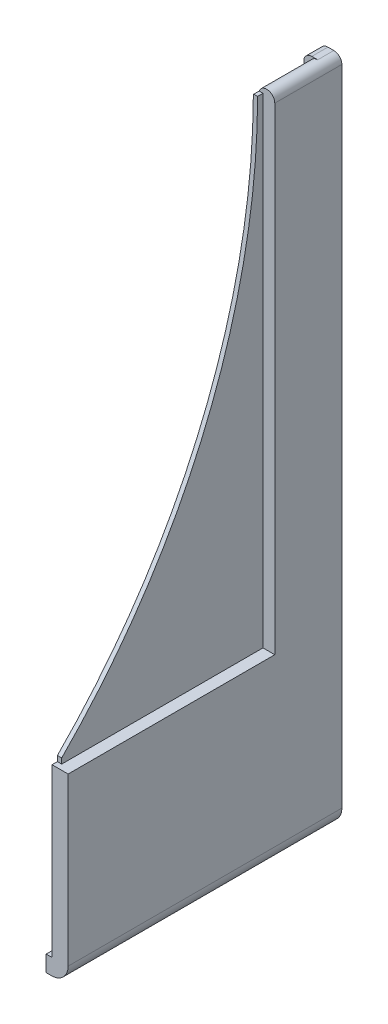
ISO-10303-21;
HEADER;
FILE_DESCRIPTION(('STEP AP214'),'2;1');
FILE_NAME('part.step','',(''),(''),'','','');
FILE_SCHEMA(('AUTOMOTIVE_DESIGN { 1 0 10303 214 1 1 1 1 }'));
ENDSEC;
DATA;
#1=APPLICATION_CONTEXT('core data for automotive mechanical design processes');
#2=APPLICATION_PROTOCOL_DEFINITION('international standard','automotive_design',2000,#1);
#3=PRODUCT_CONTEXT('',#1,'mechanical');
#4=PRODUCT('Part','Part','',(#3));
#5=PRODUCT_RELATED_PRODUCT_CATEGORY('part','',(#4));
#6=PRODUCT_DEFINITION_FORMATION('','',#4);
#7=PRODUCT_DEFINITION_CONTEXT('part definition',#1,'design');
#8=PRODUCT_DEFINITION('design','',#6,#7);
#9=PRODUCT_DEFINITION_SHAPE('','',#8);
#10=(LENGTH_UNIT() NAMED_UNIT(*) SI_UNIT(.MILLI.,.METRE.));
#11=(NAMED_UNIT(*) PLANE_ANGLE_UNIT() SI_UNIT($,.RADIAN.));
#12=(NAMED_UNIT(*) SI_UNIT($,.STERADIAN.) SOLID_ANGLE_UNIT());
#13=UNCERTAINTY_MEASURE_WITH_UNIT(LENGTH_MEASURE(1.E-05),#10,'distance_accuracy_value','');
#14=(GEOMETRIC_REPRESENTATION_CONTEXT(3) GLOBAL_UNCERTAINTY_ASSIGNED_CONTEXT((#13)) GLOBAL_UNIT_ASSIGNED_CONTEXT((#10,
#11,#12)) REPRESENTATION_CONTEXT('',''));
#15=CARTESIAN_POINT('',(0.,0.,0.));
#16=DIRECTION('',(0.,0.,1.));
#17=DIRECTION('',(1.,0.,0.));
#18=AXIS2_PLACEMENT_3D('',#15,#16,#17);
#19=CARTESIAN_POINT('',(2.59999999999955,120.1,48.));
#20=DIRECTION('',(0.,0.,-1.));
#21=DIRECTION('',(-1.,0.,0.));
#22=AXIS2_PLACEMENT_3D('',#19,#20,#21);
#23=CYLINDRICAL_SURFACE('',#22,1.5);
#24=DIRECTION('',(0.,0.,-1.));
#25=VECTOR('',#24,1.);
#26=CARTESIAN_POINT('',(1.09999999999955,120.1,48.));
#27=LINE('',#26,#25);
#28=CARTESIAN_POINT('',(1.09999999999955,120.1,10.5009956938389));
#29=VERTEX_POINT('',#28);
#30=CARTESIAN_POINT('',(1.09999999999955,120.1,0.));
#31=VERTEX_POINT('',#30);
#32=EDGE_CURVE('E12',#29,#31,#27,.T.);
#33=ORIENTED_EDGE('',*,*,#32,.F.);
#34=CARTESIAN_POINT('',(1.09999999999955,120.1,10.5009956938389));
#35=CARTESIAN_POINT('',(1.09999564035827,120.142632618884,10.5008256892034));
#36=CARTESIAN_POINT('',(1.1018175294464,120.185264580547,10.5006778200858));
#37=CARTESIAN_POINT('',(1.10905490204229,120.269914805577,10.5004269151483));
#38=CARTESIAN_POINT('',(1.11444455078887,120.311935277481,10.5003235657701));
#39=CARTESIAN_POINT('',(1.12875960021935,120.395369667685,10.5001598389847));
#40=CARTESIAN_POINT('',(1.13768500090208,120.436783585987,10.5000994615775));
#41=CARTESIAN_POINT('',(1.15907832458292,120.519005373769,10.5000193019113));
#42=CARTESIAN_POINT('',(1.17157134151145,120.559806715017,10.4999998156802));
#43=CARTESIAN_POINT('',(1.18578643762645,120.6,10.5));
#44=B_SPLINE_CURVE_WITH_KNOTS('',3,(#34,#35,#36,#37,#38,#39,#40,#41,#42,#43),.UNSPECIFIED.,.F.,
.F.,(4,2,2,2,4),(0.,0.127858771512731,0.254801677722977,0.381744583891194,0.509603355408305),.UNSPECIFIED.);
#45=CARTESIAN_POINT('',(1.18578643762645,120.6,10.5));
#46=VERTEX_POINT('',#45);
#47=EDGE_CURVE('E196',#29,#46,#44,.T.);
#48=ORIENTED_EDGE('',*,*,#47,.T.);
#49=DIRECTION('',(0.,0.,-1.));
#50=VECTOR('',#49,1.);
#51=CARTESIAN_POINT('',(1.18578643762645,120.6,48.));
#52=LINE('',#51,#50);
#53=CARTESIAN_POINT('',(1.18578643762645,120.6,9.50000000000001));
#54=VERTEX_POINT('',#53);
#55=EDGE_CURVE('E161',#46,#54,#52,.T.);
#56=ORIENTED_EDGE('',*,*,#55,.T.);
#57=CARTESIAN_POINT('',(2.59999999999955,120.1,9.50000000000001));
#58=DIRECTION('',(0.,0.,-1.));
#59=DIRECTION('',(0.,1.,0.));
#60=AXIS2_PLACEMENT_3D('',#57,#58,#59);
#61=CIRCLE('',#60,1.5);
#62=CARTESIAN_POINT('',(4.09999999999955,120.1,9.50000000000001));
#63=VERTEX_POINT('',#62);
#64=EDGE_CURVE('E288',#63,#54,#61,.F.);
#65=ORIENTED_EDGE('',*,*,#64,.F.);
#66=DIRECTION('',(0.,0.,-1.));
#67=VECTOR('',#66,1.);
#68=CARTESIAN_POINT('',(4.09999999999955,120.1,48.));
#69=LINE('',#68,#67);
#70=CARTESIAN_POINT('',(4.09999999999955,120.1,-3.));
#71=VERTEX_POINT('',#70);
#72=EDGE_CURVE('E339',#63,#71,#69,.T.);
#73=ORIENTED_EDGE('',*,*,#72,.T.);
#74=CARTESIAN_POINT('',(2.59999999999955,120.1,-3.));
#75=DIRECTION('',(0.,0.,-1.));
#76=DIRECTION('',(-1.,0.,0.));
#77=AXIS2_PLACEMENT_3D('',#74,#75,#76);
#78=CIRCLE('',#77,1.5);
#79=CARTESIAN_POINT('',(2.59999999999955,121.6,-3.));
#80=VERTEX_POINT('',#79);
#81=EDGE_CURVE('E294',#80,#71,#78,.T.);
#82=ORIENTED_EDGE('',*,*,#81,.F.);
#83=DIRECTION('',(0.,0.,1.));
#84=VECTOR('',#83,1.);
#85=CARTESIAN_POINT('',(2.59999999999955,121.6,-3.));
#86=LINE('',#85,#84);
#87=CARTESIAN_POINT('',(2.59999999999955,121.6,0.));
#88=VERTEX_POINT('',#87);
#89=EDGE_CURVE('E346',#80,#88,#86,.T.);
#90=ORIENTED_EDGE('',*,*,#89,.T.);
#91=CARTESIAN_POINT('',(2.59999999999955,120.1,0.));
#92=DIRECTION('',(0.,0.,1.));
#93=DIRECTION('',(1.,0.,0.));
#94=AXIS2_PLACEMENT_3D('',#91,#92,#93);
#95=CIRCLE('',#94,1.5);
#96=EDGE_CURVE('E61',#31,#88,#95,.F.);
#97=ORIENTED_EDGE('',*,*,#96,.F.);
#98=EDGE_LOOP('',(#33,#48,#56,#65,#73,#82,#90,#97));
#99=FACE_BOUND('',#98,.T.);
#100=ADVANCED_FACE('F36',(#99),#23,.T.);
#101=CARTESIAN_POINT('',(1.1,0.,48.));
#102=DIRECTION('',(-1.,0.,0.));
#103=DIRECTION('',(0.,-1.,0.));
#104=AXIS2_PLACEMENT_3D('',#101,#102,#103);
#105=PLANE('',#104);
#106=DIRECTION('',(0.,-1.,0.));
#107=VECTOR('',#106,1.);
#108=CARTESIAN_POINT('',(1.1,0.,47.));
#109=LINE('',#108,#107);
#110=CARTESIAN_POINT('',(1.09999999999988,32.1,47.));
#111=VERTEX_POINT('',#110);
#112=CARTESIAN_POINT('',(1.09999999999988,31.1,47.));
#113=VERTEX_POINT('',#112);
#114=EDGE_CURVE('E191',#111,#113,#109,.T.);
#115=ORIENTED_EDGE('',*,*,#114,.F.);
#116=CARTESIAN_POINT('',(1.09999999999955,120.6,136.041095890411));
#117=DIRECTION('',(-1.,0.,0.));
#118=DIRECTION('',(0.,-1.,0.));
#119=AXIS2_PLACEMENT_3D('',#116,#117,#118);
#120=CIRCLE('',#119,125.541095890411);
#121=EDGE_CURVE('E193',#111,#29,#120,.F.);
#122=ORIENTED_EDGE('',*,*,#121,.T.);
#123=ORIENTED_EDGE('',*,*,#32,.T.);
#124=DIRECTION('',(0.,1.,0.));
#125=VECTOR('',#124,1.);
#126=CARTESIAN_POINT('',(1.1,0.,0.));
#127=LINE('',#126,#125);
#128=CARTESIAN_POINT('',(1.1,0.1,0.));
#129=VERTEX_POINT('',#128);
#130=EDGE_CURVE('E342',#129,#31,#127,.T.);
#131=ORIENTED_EDGE('',*,*,#130,.F.);
#132=DIRECTION('',(0.,0.,-1.));
#133=VECTOR('',#132,1.);
#134=CARTESIAN_POINT('',(1.1,0.1,48.));
#135=LINE('',#134,#133);
#136=CARTESIAN_POINT('',(1.1,0.1,48.));
#137=VERTEX_POINT('',#136);
#138=EDGE_CURVE('E45',#137,#129,#135,.T.);
#139=ORIENTED_EDGE('',*,*,#138,.F.);
#140=DIRECTION('',(0.,1.,0.));
#141=VECTOR('',#140,1.);
#142=CARTESIAN_POINT('',(1.1,0.,48.));
#143=LINE('',#142,#141);
#144=CARTESIAN_POINT('',(1.09999999999977,31.1,48.));
#145=VERTEX_POINT('',#144);
#146=EDGE_CURVE('E320',#137,#145,#143,.T.);
#147=ORIENTED_EDGE('',*,*,#146,.T.);
#148=DIRECTION('',(0.,0.,1.));
#149=VECTOR('',#148,1.);
#150=CARTESIAN_POINT('',(1.09999999999988,31.1,48.));
#151=LINE('',#150,#149);
#152=EDGE_CURVE('E188',#113,#145,#151,.T.);
#153=ORIENTED_EDGE('',*,*,#152,.F.);
#154=EDGE_LOOP('',(#115,#122,#123,#131,#139,#147,#153));
#155=FACE_BOUND('',#154,.T.);
#156=ADVANCED_FACE('F262',(#155),#105,.T.);
#157=CARTESIAN_POINT('',(0.999999999999999,0.0999999999999998,48.));
#158=DIRECTION('',(0.,0.,-1.));
#159=DIRECTION('',(-1.,0.,0.));
#160=AXIS2_PLACEMENT_3D('',#157,#158,#159);
#161=CYLINDRICAL_SURFACE('',#160,0.0999999999999996);
#162=CARTESIAN_POINT('',(0.999999999999999,0.0999999999999998,0.));
#163=DIRECTION('',(0.,0.,1.));
#164=DIRECTION('',(1.,0.,0.));
#165=AXIS2_PLACEMENT_3D('',#162,#163,#164);
#166=CIRCLE('',#165,0.0999999999999996);
#167=CARTESIAN_POINT('',(0.999999999999999,0.,0.));
#168=VERTEX_POINT('',#167);
#169=EDGE_CURVE('E356',#168,#129,#166,.T.);
#170=ORIENTED_EDGE('',*,*,#169,.F.);
#171=DIRECTION('',(0.,0.,-1.));
#172=VECTOR('',#171,1.);
#173=CARTESIAN_POINT('',(0.999999999999999,0.,48.));
#174=LINE('',#173,#172);
#175=CARTESIAN_POINT('',(0.999999999999999,0.,48.));
#176=VERTEX_POINT('',#175);
#177=EDGE_CURVE('E350',#176,#168,#174,.T.);
#178=ORIENTED_EDGE('',*,*,#177,.F.);
#179=CARTESIAN_POINT('',(0.999999999999999,0.0999999999999998,48.));
#180=DIRECTION('',(0.,0.,1.));
#181=DIRECTION('',(1.,0.,0.));
#182=AXIS2_PLACEMENT_3D('',#179,#180,#181);
#183=CIRCLE('',#182,0.0999999999999996);
#184=EDGE_CURVE('E322',#176,#137,#183,.T.);
#185=ORIENTED_EDGE('',*,*,#184,.T.);
#186=ORIENTED_EDGE('',*,*,#138,.T.);
#187=EDGE_LOOP('',(#170,#178,#185,#186));
#188=FACE_BOUND('',#187,.T.);
#189=ADVANCED_FACE('F259',(#188),#161,.F.);
#190=CARTESIAN_POINT('',(0.,0.,48.));
#191=DIRECTION('',(0.,1.,0.));
#192=DIRECTION('',(0.,0.,1.));
#193=AXIS2_PLACEMENT_3D('',#190,#191,#192);
#194=PLANE('',#193);
#195=DIRECTION('',(1.,0.,0.));
#196=VECTOR('',#195,1.);
#197=CARTESIAN_POINT('',(0.,0.,0.));
#198=LINE('',#197,#196);
#199=CARTESIAN_POINT('',(0.,0.,0.));
#200=VERTEX_POINT('',#199);
#201=EDGE_CURVE('E323',#200,#168,#198,.T.);
#202=ORIENTED_EDGE('',*,*,#201,.F.);
#203=DIRECTION('',(0.,0.,-1.));
#204=VECTOR('',#203,1.);
#205=CARTESIAN_POINT('',(0.,0.,48.));
#206=LINE('',#205,#204);
#207=CARTESIAN_POINT('',(0.,0.,48.));
#208=VERTEX_POINT('',#207);
#209=EDGE_CURVE('E348',#208,#200,#206,.T.);
#210=ORIENTED_EDGE('',*,*,#209,.F.);
#211=DIRECTION('',(1.,0.,0.));
#212=VECTOR('',#211,1.);
#213=CARTESIAN_POINT('',(0.,0.,48.));
#214=LINE('',#213,#212);
#215=EDGE_CURVE('E326',#208,#176,#214,.T.);
#216=ORIENTED_EDGE('',*,*,#215,.T.);
#217=ORIENTED_EDGE('',*,*,#177,.T.);
#218=EDGE_LOOP('',(#202,#210,#216,#217));
#219=FACE_BOUND('',#218,.T.);
#220=ADVANCED_FACE('F255',(#219),#194,.T.);
#221=CARTESIAN_POINT('',(0.,0.,48.));
#222=DIRECTION('',(-1.,0.,0.));
#223=DIRECTION('',(0.,0.,1.));
#224=AXIS2_PLACEMENT_3D('',#221,#222,#223);
#225=PLANE('',#224);
#226=ORIENTED_EDGE('',*,*,#209,.T.);
#227=DIRECTION('',(0.,1.,0.));
#228=VECTOR('',#227,1.);
#229=CARTESIAN_POINT('',(0.,0.,0.));
#230=LINE('',#229,#228);
#231=CARTESIAN_POINT('',(0.,120.1,0.));
#232=VERTEX_POINT('',#231);
#233=EDGE_CURVE('E316',#200,#232,#230,.T.);
#234=ORIENTED_EDGE('',*,*,#233,.T.);
#235=DIRECTION('',(0.,0.,1.));
#236=VECTOR('',#235,1.);
#237=CARTESIAN_POINT('',(0.,120.1,-3.));
#238=LINE('',#237,#236);
#239=CARTESIAN_POINT('',(0.,120.1,-3.));
#240=VERTEX_POINT('',#239);
#241=EDGE_CURVE('E319',#240,#232,#238,.T.);
#242=ORIENTED_EDGE('',*,*,#241,.F.);
#243=DIRECTION('',(0.,1.,0.));
#244=VECTOR('',#243,1.);
#245=CARTESIAN_POINT('',(0.,0.,-3.));
#246=LINE('',#245,#244);
#247=CARTESIAN_POINT('',(0.,-3.,-3.));
#248=VERTEX_POINT('',#247);
#249=EDGE_CURVE('E307',#248,#240,#246,.T.);
#250=ORIENTED_EDGE('',*,*,#249,.F.);
#251=DIRECTION('',(0.,0.,-1.));
#252=VECTOR('',#251,1.);
#253=CARTESIAN_POINT('',(0.,-3.,48.));
#254=LINE('',#253,#252);
#255=CARTESIAN_POINT('',(0.,-3.,48.));
#256=VERTEX_POINT('',#255);
#257=EDGE_CURVE('E351',#256,#248,#254,.T.);
#258=ORIENTED_EDGE('',*,*,#257,.F.);
#259=DIRECTION('',(0.,1.,0.));
#260=VECTOR('',#259,1.);
#261=CARTESIAN_POINT('',(0.,0.,48.));
#262=LINE('',#261,#260);
#263=EDGE_CURVE('E329',#256,#208,#262,.T.);
#264=ORIENTED_EDGE('',*,*,#263,.T.);
#265=EDGE_LOOP('',(#226,#234,#242,#250,#258,#264));
#266=FACE_BOUND('',#265,.T.);
#267=ADVANCED_FACE('F251',(#266),#225,.T.);
#268=CARTESIAN_POINT('',(0.,-3.,48.));
#269=DIRECTION('',(0.,1.,0.));
#270=DIRECTION('',(0.,0.,1.));
#271=AXIS2_PLACEMENT_3D('',#268,#269,#270);
#272=PLANE('',#271);
#273=ORIENTED_EDGE('',*,*,#257,.T.);
#274=DIRECTION('',(-1.,0.,0.));
#275=VECTOR('',#274,1.);
#276=CARTESIAN_POINT('',(0.,-3.,-3.));
#277=LINE('',#276,#275);
#278=CARTESIAN_POINT('',(0.999999999999999,-3.,-3.));
#279=VERTEX_POINT('',#278);
#280=EDGE_CURVE('E304',#279,#248,#277,.T.);
#281=ORIENTED_EDGE('',*,*,#280,.F.);
#282=DIRECTION('',(0.,0.,-1.));
#283=VECTOR('',#282,1.);
#284=CARTESIAN_POINT('',(0.999999999999999,-3.,48.));
#285=LINE('',#284,#283);
#286=CARTESIAN_POINT('',(0.999999999999999,-3.,48.));
#287=VERTEX_POINT('',#286);
#288=EDGE_CURVE('E382',#287,#279,#285,.T.);
#289=ORIENTED_EDGE('',*,*,#288,.F.);
#290=DIRECTION('',(1.,0.,0.));
#291=VECTOR('',#290,1.);
#292=CARTESIAN_POINT('',(0.,-3.,48.));
#293=LINE('',#292,#291);
#294=EDGE_CURVE('E332',#256,#287,#293,.T.);
#295=ORIENTED_EDGE('',*,*,#294,.F.);
#296=EDGE_LOOP('',(#273,#281,#289,#295));
#297=FACE_BOUND('',#296,.T.);
#298=ADVANCED_FACE('F247',(#297),#272,.F.);
#299=CARTESIAN_POINT('',(0.999999999999999,0.0999999999999998,48.));
#300=DIRECTION('',(0.,0.,-1.));
#301=DIRECTION('',(-1.,0.,0.));
#302=AXIS2_PLACEMENT_3D('',#299,#300,#301);
#303=CYLINDRICAL_SURFACE('',#302,3.1);
#304=ORIENTED_EDGE('',*,*,#288,.T.);
#305=CARTESIAN_POINT('',(0.999999999999999,0.0999999999999998,-3.));
#306=DIRECTION('',(0.,0.,-1.));
#307=DIRECTION('',(-1.,0.,0.));
#308=AXIS2_PLACEMENT_3D('',#305,#306,#307);
#309=CIRCLE('',#308,3.1);
#310=CARTESIAN_POINT('',(4.1,0.0999999999999998,-3.));
#311=VERTEX_POINT('',#310);
#312=EDGE_CURVE('E301',#311,#279,#309,.T.);
#313=ORIENTED_EDGE('',*,*,#312,.F.);
#314=DIRECTION('',(0.,0.,-1.));
#315=VECTOR('',#314,1.);
#316=CARTESIAN_POINT('',(4.1,0.10000000000001,48.));
#317=LINE('',#316,#315);
#318=CARTESIAN_POINT('',(4.1,0.10000000000001,48.));
#319=VERTEX_POINT('',#318);
#320=EDGE_CURVE('E380',#319,#311,#317,.T.);
#321=ORIENTED_EDGE('',*,*,#320,.F.);
#322=CARTESIAN_POINT('',(0.999999999999999,0.0999999999999998,48.));
#323=DIRECTION('',(0.,0.,1.));
#324=DIRECTION('',(1.,0.,0.));
#325=AXIS2_PLACEMENT_3D('',#322,#323,#324);
#326=CIRCLE('',#325,3.1);
#327=EDGE_CURVE('E334',#287,#319,#326,.T.);
#328=ORIENTED_EDGE('',*,*,#327,.F.);
#329=EDGE_LOOP('',(#304,#313,#321,#328));
#330=FACE_BOUND('',#329,.T.);
#331=ADVANCED_FACE('F243',(#330),#303,.T.);
#332=CARTESIAN_POINT('',(4.1,0.,48.));
#333=DIRECTION('',(-1.,0.,0.));
#334=DIRECTION('',(0.,-1.,0.));
#335=AXIS2_PLACEMENT_3D('',#332,#333,#334);
#336=PLANE('',#335);
#337=DIRECTION('',(0.,1.,0.));
#338=VECTOR('',#337,1.);
#339=CARTESIAN_POINT('',(4.09999999999954,121.6,9.50000000000001));
#340=LINE('',#339,#338);
#341=CARTESIAN_POINT('',(4.09999999999988,31.1,9.49999999999999));
#342=VERTEX_POINT('',#341);
#343=EDGE_CURVE('E203',#342,#63,#340,.T.);
#344=ORIENTED_EDGE('',*,*,#343,.F.);
#345=DIRECTION('',(0.,0.,-1.));
#346=VECTOR('',#345,1.);
#347=CARTESIAN_POINT('',(4.09999999999988,31.1,48.));
#348=LINE('',#347,#346);
#349=CARTESIAN_POINT('',(4.09999999999988,31.1,48.));
#350=VERTEX_POINT('',#349);
#351=EDGE_CURVE('E202',#350,#342,#348,.T.);
#352=ORIENTED_EDGE('',*,*,#351,.F.);
#353=DIRECTION('',(0.,1.,0.));
#354=VECTOR('',#353,1.);
#355=CARTESIAN_POINT('',(4.1,0.,48.));
#356=LINE('',#355,#354);
#357=EDGE_CURVE('E336',#319,#350,#356,.T.);
#358=ORIENTED_EDGE('',*,*,#357,.F.);
#359=ORIENTED_EDGE('',*,*,#320,.T.);
#360=DIRECTION('',(0.,-1.,0.));
#361=VECTOR('',#360,1.);
#362=CARTESIAN_POINT('',(4.1,0.,-3.));
#363=LINE('',#362,#361);
#364=EDGE_CURVE('E298',#71,#311,#363,.T.);
#365=ORIENTED_EDGE('',*,*,#364,.F.);
#366=ORIENTED_EDGE('',*,*,#72,.F.);
#367=EDGE_LOOP('',(#344,#352,#358,#359,#365,#366));
#368=FACE_BOUND('',#367,.T.);
#369=ADVANCED_FACE('F239',(#368),#336,.F.);
#370=CARTESIAN_POINT('',(0.,0.,48.));
#371=DIRECTION('',(0.,0.,1.));
#372=DIRECTION('',(1.,0.,0.));
#373=AXIS2_PLACEMENT_3D('',#370,#371,#372);
#374=PLANE('',#373);
#375=DIRECTION('',(1.,0.,0.));
#376=VECTOR('',#375,1.);
#377=CARTESIAN_POINT('',(-97.2488688292856,31.0999999999996,48.));
#378=LINE('',#377,#376);
#379=EDGE_CURVE('E285',#145,#350,#378,.T.);
#380=ORIENTED_EDGE('',*,*,#379,.F.);
#381=ORIENTED_EDGE('',*,*,#146,.F.);
#382=ORIENTED_EDGE('',*,*,#184,.F.);
#383=ORIENTED_EDGE('',*,*,#215,.F.);
#384=ORIENTED_EDGE('',*,*,#263,.F.);
#385=ORIENTED_EDGE('',*,*,#294,.T.);
#386=ORIENTED_EDGE('',*,*,#327,.T.);
#387=ORIENTED_EDGE('',*,*,#357,.T.);
#388=EDGE_LOOP('',(#380,#381,#382,#383,#384,#385,#386,#387));
#389=FACE_BOUND('',#388,.T.);
#390=ADVANCED_FACE('F230',(#389),#374,.T.);
#391=CARTESIAN_POINT('',(0.,0.,0.));
#392=DIRECTION('',(0.,0.,-1.));
#393=DIRECTION('',(-1.,0.,0.));
#394=AXIS2_PLACEMENT_3D('',#391,#392,#393);
#395=PLANE('',#394);
#396=ORIENTED_EDGE('',*,*,#130,.T.);
#397=ORIENTED_EDGE('',*,*,#96,.T.);
#398=DIRECTION('',(1.,0.,0.));
#399=VECTOR('',#398,1.);
#400=CARTESIAN_POINT('',(0.,121.6,0.));
#401=LINE('',#400,#399);
#402=CARTESIAN_POINT('',(1.5,121.6,0.));
#403=VERTEX_POINT('',#402);
#404=EDGE_CURVE('E290',#403,#88,#401,.T.);
#405=ORIENTED_EDGE('',*,*,#404,.F.);
#406=CARTESIAN_POINT('',(1.5,120.1,0.));
#407=DIRECTION('',(0.,0.,-1.));
#408=DIRECTION('',(-1.,0.,0.));
#409=AXIS2_PLACEMENT_3D('',#406,#407,#408);
#410=CIRCLE('',#409,1.5);
#411=EDGE_CURVE('E295',#232,#403,#410,.T.);
#412=ORIENTED_EDGE('',*,*,#411,.F.);
#413=ORIENTED_EDGE('',*,*,#233,.F.);
#414=ORIENTED_EDGE('',*,*,#201,.T.);
#415=ORIENTED_EDGE('',*,*,#169,.T.);
#416=EDGE_LOOP('',(#396,#397,#405,#412,#413,#414,#415));
#417=FACE_BOUND('',#416,.T.);
#418=ADVANCED_FACE('F226',(#417),#395,.F.);
#419=CARTESIAN_POINT('',(0.,121.6,-3.));
#420=DIRECTION('',(0.,-1.,0.));
#421=DIRECTION('',(0.,0.,-1.));
#422=AXIS2_PLACEMENT_3D('',#419,#420,#421);
#423=PLANE('',#422);
#424=ORIENTED_EDGE('',*,*,#404,.T.);
#425=ORIENTED_EDGE('',*,*,#89,.F.);
#426=DIRECTION('',(1.,0.,0.));
#427=VECTOR('',#426,1.);
#428=CARTESIAN_POINT('',(0.,121.6,-3.));
#429=LINE('',#428,#427);
#430=CARTESIAN_POINT('',(1.5,121.6,-3.));
#431=VERTEX_POINT('',#430);
#432=EDGE_CURVE('E291',#431,#80,#429,.T.);
#433=ORIENTED_EDGE('',*,*,#432,.F.);
#434=DIRECTION('',(0.,0.,1.));
#435=VECTOR('',#434,1.);
#436=CARTESIAN_POINT('',(1.5,121.6,-3.));
#437=LINE('',#436,#435);
#438=EDGE_CURVE('E311',#431,#403,#437,.T.);
#439=ORIENTED_EDGE('',*,*,#438,.T.);
#440=EDGE_LOOP('',(#424,#425,#433,#439));
#441=FACE_BOUND('',#440,.T.);
#442=ADVANCED_FACE('F229',(#441),#423,.F.);
#443=CARTESIAN_POINT('',(1.5,120.1,-3.));
#444=DIRECTION('',(0.,0.,1.));
#445=DIRECTION('',(1.,0.,0.));
#446=AXIS2_PLACEMENT_3D('',#443,#444,#445);
#447=CYLINDRICAL_SURFACE('',#446,1.5);
#448=ORIENTED_EDGE('',*,*,#411,.T.);
#449=ORIENTED_EDGE('',*,*,#438,.F.);
#450=CARTESIAN_POINT('',(1.5,120.1,-3.));
#451=DIRECTION('',(0.,0.,-1.));
#452=DIRECTION('',(-1.,0.,0.));
#453=AXIS2_PLACEMENT_3D('',#450,#451,#452);
#454=CIRCLE('',#453,1.5);
#455=EDGE_CURVE('E309',#240,#431,#454,.T.);
#456=ORIENTED_EDGE('',*,*,#455,.F.);
#457=ORIENTED_EDGE('',*,*,#241,.T.);
#458=EDGE_LOOP('',(#448,#449,#456,#457));
#459=FACE_BOUND('',#458,.T.);
#460=ADVANCED_FACE('F224',(#459),#447,.T.);
#461=CARTESIAN_POINT('',(0.,0.,-3.));
#462=DIRECTION('',(0.,0.,-1.));
#463=DIRECTION('',(-1.,0.,0.));
#464=AXIS2_PLACEMENT_3D('',#461,#462,#463);
#465=PLANE('',#464);
#466=ORIENTED_EDGE('',*,*,#432,.T.);
#467=ORIENTED_EDGE('',*,*,#81,.T.);
#468=ORIENTED_EDGE('',*,*,#364,.T.);
#469=ORIENTED_EDGE('',*,*,#312,.T.);
#470=ORIENTED_EDGE('',*,*,#280,.T.);
#471=ORIENTED_EDGE('',*,*,#249,.T.);
#472=ORIENTED_EDGE('',*,*,#455,.T.);
#473=EDGE_LOOP('',(#466,#467,#468,#469,#470,#471,#472));
#474=FACE_BOUND('',#473,.T.);
#475=ADVANCED_FACE('F221',(#474),#465,.T.);
#476=CARTESIAN_POINT('',(1.9,0.,48.));
#477=DIRECTION('',(-1.,0.,0.));
#478=DIRECTION('',(0.,-1.,0.));
#479=AXIS2_PLACEMENT_3D('',#476,#477,#478);
#480=PLANE('',#479);
#481=CARTESIAN_POINT('',(1.89999999999955,120.6,136.041095890411));
#482=DIRECTION('',(1.,0.,0.));
#483=DIRECTION('',(0.,1.,0.));
#484=AXIS2_PLACEMENT_3D('',#481,#482,#483);
#485=CIRCLE('',#484,125.541095890411);
#486=CARTESIAN_POINT('',(1.89999999999955,120.6,10.5));
#487=VERTEX_POINT('',#486);
#488=CARTESIAN_POINT('',(1.89999999999988,32.1,47.));
#489=VERTEX_POINT('',#488);
#490=EDGE_CURVE('E168',#487,#489,#485,.F.);
#491=ORIENTED_EDGE('',*,*,#490,.T.);
#492=DIRECTION('',(0.,1.,0.));
#493=VECTOR('',#492,1.);
#494=CARTESIAN_POINT('',(1.9,0.,47.));
#495=LINE('',#494,#493);
#496=CARTESIAN_POINT('',(1.89999999999988,31.1,47.));
#497=VERTEX_POINT('',#496);
#498=EDGE_CURVE('E165',#497,#489,#495,.T.);
#499=ORIENTED_EDGE('',*,*,#498,.F.);
#500=DIRECTION('',(0.,0.,-1.));
#501=VECTOR('',#500,1.);
#502=CARTESIAN_POINT('',(1.89999999999989,31.1,48.));
#503=LINE('',#502,#501);
#504=CARTESIAN_POINT('',(1.89999999999989,31.1,9.49999999999999));
#505=VERTEX_POINT('',#504);
#506=EDGE_CURVE('E278',#497,#505,#503,.T.);
#507=ORIENTED_EDGE('',*,*,#506,.T.);
#508=DIRECTION('',(0.,1.,0.));
#509=VECTOR('',#508,1.);
#510=CARTESIAN_POINT('',(1.89999999999954,121.6,9.50000000000001));
#511=LINE('',#510,#509);
#512=CARTESIAN_POINT('',(1.89999999999954,120.6,9.50000000000001));
#513=VERTEX_POINT('',#512);
#514=EDGE_CURVE('E179',#505,#513,#511,.T.);
#515=ORIENTED_EDGE('',*,*,#514,.T.);
#516=DIRECTION('',(0.,0.,1.));
#517=VECTOR('',#516,1.);
#518=CARTESIAN_POINT('',(1.89999999999955,120.6,0.));
#519=LINE('',#518,#517);
#520=EDGE_CURVE('E53',#513,#487,#519,.T.);
#521=ORIENTED_EDGE('',*,*,#520,.T.);
#522=EDGE_LOOP('',(#491,#499,#507,#515,#521));
#523=FACE_BOUND('',#522,.T.);
#524=ADVANCED_FACE('F177',(#523),#480,.F.);
#525=CARTESIAN_POINT('',(-97.2488688292856,31.0999999999996,48.));
#526=DIRECTION('',(0.,-1.,0.));
#527=DIRECTION('',(1.,0.,0.));
#528=AXIS2_PLACEMENT_3D('',#525,#526,#527);
#529=PLANE('',#528);
#530=ORIENTED_EDGE('',*,*,#379,.T.);
#531=ORIENTED_EDGE('',*,*,#351,.T.);
#532=DIRECTION('',(1.,0.,0.));
#533=VECTOR('',#532,1.);
#534=CARTESIAN_POINT('',(-97.2488688292856,31.0999999999996,9.49999999999999));
#535=LINE('',#534,#533);
#536=EDGE_CURVE('E280',#505,#342,#535,.T.);
#537=ORIENTED_EDGE('',*,*,#536,.F.);
#538=ORIENTED_EDGE('',*,*,#506,.F.);
#539=DIRECTION('',(1.,0.,0.));
#540=VECTOR('',#539,1.);
#541=CARTESIAN_POINT('',(-5.00000001272052E-05,31.1,47.));
#542=LINE('',#541,#540);
#543=EDGE_CURVE('E184',#113,#497,#542,.T.);
#544=ORIENTED_EDGE('',*,*,#543,.F.);
#545=ORIENTED_EDGE('',*,*,#152,.T.);
#546=EDGE_LOOP('',(#530,#531,#537,#538,#544,#545));
#547=FACE_BOUND('',#546,.T.);
#548=ADVANCED_FACE('F214',(#547),#529,.F.);
#549=CARTESIAN_POINT('',(-97.2488688292859,121.6,9.50000000000001));
#550=DIRECTION('',(0.,0.,-1.));
#551=DIRECTION('',(0.,1.,0.));
#552=AXIS2_PLACEMENT_3D('',#549,#550,#551);
#553=PLANE('',#552);
#554=ORIENTED_EDGE('',*,*,#64,.T.);
#555=DIRECTION('',(1.,0.,0.));
#556=VECTOR('',#555,1.);
#557=CARTESIAN_POINT('',(-5.00000004613563E-05,120.6,9.50000000000001));
#558=LINE('',#557,#556);
#559=EDGE_CURVE('E164',#54,#513,#558,.T.);
#560=ORIENTED_EDGE('',*,*,#559,.T.);
#561=ORIENTED_EDGE('',*,*,#514,.F.);
#562=ORIENTED_EDGE('',*,*,#536,.T.);
#563=ORIENTED_EDGE('',*,*,#343,.T.);
#564=EDGE_LOOP('',(#554,#560,#561,#562,#563));
#565=FACE_BOUND('',#564,.T.);
#566=ADVANCED_FACE('F210',(#565),#553,.F.);
#567=CARTESIAN_POINT('',(-5.00000004613563E-05,120.6,136.041095890411));
#568=DIRECTION('',(1.,0.,0.));
#569=DIRECTION('',(0.,1.,0.));
#570=AXIS2_PLACEMENT_3D('',#567,#568,#569);
#571=CYLINDRICAL_SURFACE('',#570,125.541095890411);
#572=ORIENTED_EDGE('',*,*,#121,.F.);
#573=DIRECTION('',(1.,0.,0.));
#574=VECTOR('',#573,1.);
#575=CARTESIAN_POINT('',(-5.00000001308915E-05,32.1,47.));
#576=LINE('',#575,#574);
#577=EDGE_CURVE('E171',#111,#489,#576,.T.);
#578=ORIENTED_EDGE('',*,*,#577,.T.);
#579=ORIENTED_EDGE('',*,*,#490,.F.);
#580=DIRECTION('',(1.,0.,0.));
#581=VECTOR('',#580,1.);
#582=CARTESIAN_POINT('',(-5.00000004613563E-05,120.6,10.5));
#583=LINE('',#582,#581);
#584=EDGE_CURVE('E157',#46,#487,#583,.T.);
#585=ORIENTED_EDGE('',*,*,#584,.F.);
#586=ORIENTED_EDGE('',*,*,#47,.F.);
#587=EDGE_LOOP('',(#572,#578,#579,#585,#586));
#588=FACE_BOUND('',#587,.T.);
#589=ADVANCED_FACE('F169',(#588),#571,.F.);
#590=CARTESIAN_POINT('',(-5.00000000111956E-05,0.,47.));
#591=DIRECTION('',(0.,0.,-1.));
#592=DIRECTION('',(-1.,0.,0.));
#593=AXIS2_PLACEMENT_3D('',#590,#591,#592);
#594=PLANE('',#593);
#595=ORIENTED_EDGE('',*,*,#114,.T.);
#596=ORIENTED_EDGE('',*,*,#543,.T.);
#597=ORIENTED_EDGE('',*,*,#498,.T.);
#598=ORIENTED_EDGE('',*,*,#577,.F.);
#599=EDGE_LOOP('',(#595,#596,#597,#598));
#600=FACE_BOUND('',#599,.T.);
#601=ADVANCED_FACE('F209',(#600),#594,.F.);
#602=CARTESIAN_POINT('',(-5.00000004613563E-05,120.6,0.));
#603=DIRECTION('',(0.,1.,0.));
#604=DIRECTION('',(-1.,0.,0.));
#605=AXIS2_PLACEMENT_3D('',#602,#603,#604);
#606=PLANE('',#605);
#607=ORIENTED_EDGE('',*,*,#584,.T.);
#608=ORIENTED_EDGE('',*,*,#520,.F.);
#609=ORIENTED_EDGE('',*,*,#559,.F.);
#610=ORIENTED_EDGE('',*,*,#55,.F.);
#611=EDGE_LOOP('',(#607,#608,#609,#610));
#612=FACE_BOUND('',#611,.T.);
#613=ADVANCED_FACE('F159',(#612),#606,.T.);
#614=CLOSED_SHELL('',(#100,#156,#189,#220,#267,#298,#331,#369,#390,#418,#442,#460,#475,#524,
#548,#566,#589,#601,#613));
#615=MANIFOLD_SOLID_BREP('B2',#614);
#616=ADVANCED_BREP_SHAPE_REPRESENTATION('',(#18,#615),#14);
#617=SHAPE_DEFINITION_REPRESENTATION(#9,#616);
ENDSEC;
END-ISO-10303-21;
